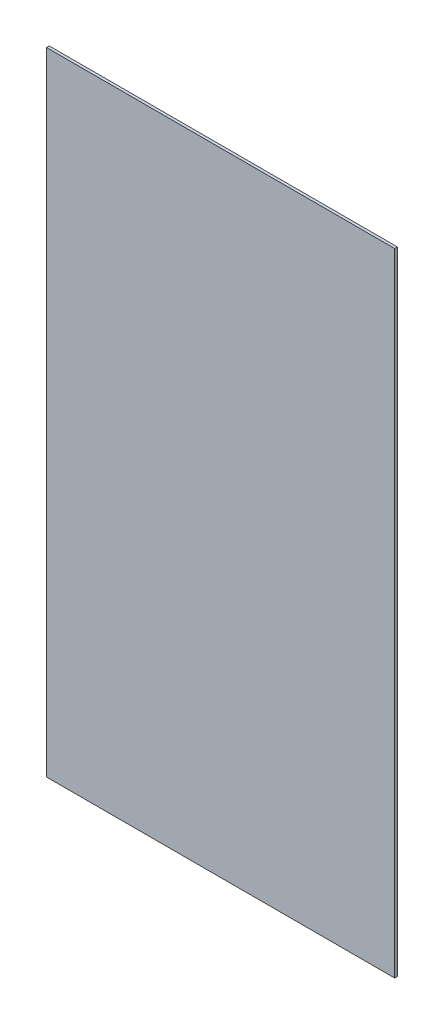
ISO-10303-21;
HEADER;
FILE_DESCRIPTION(('STEP AP214'),'2;1');
FILE_NAME('part.step','',(''),(''),'','','');
FILE_SCHEMA(('AUTOMOTIVE_DESIGN { 1 0 10303 214 1 1 1 1 }'));
ENDSEC;
DATA;
#1=APPLICATION_CONTEXT('core data for automotive mechanical design processes');
#2=APPLICATION_PROTOCOL_DEFINITION('international standard','automotive_design',2000,#1);
#3=PRODUCT_CONTEXT('',#1,'mechanical');
#4=PRODUCT('Part','Part','',(#3));
#5=PRODUCT_RELATED_PRODUCT_CATEGORY('part','',(#4));
#6=PRODUCT_DEFINITION_FORMATION('','',#4);
#7=PRODUCT_DEFINITION_CONTEXT('part definition',#1,'design');
#8=PRODUCT_DEFINITION('design','',#6,#7);
#9=PRODUCT_DEFINITION_SHAPE('','',#8);
#10=(LENGTH_UNIT() NAMED_UNIT(*) SI_UNIT(.MILLI.,.METRE.));
#11=(NAMED_UNIT(*) PLANE_ANGLE_UNIT() SI_UNIT($,.RADIAN.));
#12=(NAMED_UNIT(*) SI_UNIT($,.STERADIAN.) SOLID_ANGLE_UNIT());
#13=UNCERTAINTY_MEASURE_WITH_UNIT(LENGTH_MEASURE(1.E-05),#10,'distance_accuracy_value','');
#14=(GEOMETRIC_REPRESENTATION_CONTEXT(3) GLOBAL_UNCERTAINTY_ASSIGNED_CONTEXT((#13)) GLOBAL_UNIT_ASSIGNED_CONTEXT((#10,
#11,#12)) REPRESENTATION_CONTEXT('',''));
#15=CARTESIAN_POINT('',(0.,0.,0.));
#16=DIRECTION('',(0.,0.,1.));
#17=DIRECTION('',(1.,0.,0.));
#18=AXIS2_PLACEMENT_3D('',#15,#16,#17);
#19=CARTESIAN_POINT('',(-34.925,0.,4.7625));
#20=DIRECTION('',(1.,0.,0.));
#21=DIRECTION('',(0.,0.,-1.));
#22=AXIS2_PLACEMENT_3D('',#19,#20,#21);
#23=PLANE('',#22);
#24=DIRECTION('',(0.,-1.,0.));
#25=VECTOR('',#24,1.);
#26=CARTESIAN_POINT('',(-34.925,0.,0.));
#27=LINE('',#26,#25);
#28=CARTESIAN_POINT('',(-34.925,1095.375,0.));
#29=VERTEX_POINT('',#28);
#30=CARTESIAN_POINT('',(-34.925,0.,0.));
#31=VERTEX_POINT('',#30);
#32=EDGE_CURVE('E94',#29,#31,#27,.T.);
#33=ORIENTED_EDGE('',*,*,#32,.T.);
#34=DIRECTION('',(0.,0.,-1.));
#35=VECTOR('',#34,1.);
#36=CARTESIAN_POINT('',(-34.925,0.,4.7625));
#37=LINE('',#36,#35);
#38=CARTESIAN_POINT('',(-34.925,0.,4.7625));
#39=VERTEX_POINT('',#38);
#40=EDGE_CURVE('E11',#39,#31,#37,.T.);
#41=ORIENTED_EDGE('',*,*,#40,.F.);
#42=DIRECTION('',(0.,-1.,0.));
#43=VECTOR('',#42,1.);
#44=CARTESIAN_POINT('',(-34.925,0.,4.7625));
#45=LINE('',#44,#43);
#46=CARTESIAN_POINT('',(-34.925,1095.375,4.7625));
#47=VERTEX_POINT('',#46);
#48=EDGE_CURVE('E82',#47,#39,#45,.T.);
#49=ORIENTED_EDGE('',*,*,#48,.F.);
#50=DIRECTION('',(0.,0.,-1.));
#51=VECTOR('',#50,1.);
#52=CARTESIAN_POINT('',(-34.925,1095.375,4.7625));
#53=LINE('',#52,#51);
#54=EDGE_CURVE('E90',#47,#29,#53,.T.);
#55=ORIENTED_EDGE('',*,*,#54,.T.);
#56=EDGE_LOOP('',(#33,#41,#49,#55));
#57=FACE_BOUND('',#56,.T.);
#58=ADVANCED_FACE('F31',(#57),#23,.F.);
#59=CARTESIAN_POINT('',(-34.925,0.,4.7625));
#60=DIRECTION('',(0.,1.,0.));
#61=DIRECTION('',(0.,0.,1.));
#62=AXIS2_PLACEMENT_3D('',#59,#60,#61);
#63=PLANE('',#62);
#64=DIRECTION('',(1.,0.,0.));
#65=VECTOR('',#64,1.);
#66=CARTESIAN_POINT('',(-34.925,0.,0.));
#67=LINE('',#66,#65);
#68=CARTESIAN_POINT('',(568.325,0.,0.));
#69=VERTEX_POINT('',#68);
#70=EDGE_CURVE('E86',#31,#69,#67,.T.);
#71=ORIENTED_EDGE('',*,*,#70,.T.);
#72=DIRECTION('',(0.,0.,-1.));
#73=VECTOR('',#72,1.);
#74=CARTESIAN_POINT('',(568.325,0.,4.7625));
#75=LINE('',#74,#73);
#76=CARTESIAN_POINT('',(568.325,0.,4.7625));
#77=VERTEX_POINT('',#76);
#78=EDGE_CURVE('E39',#77,#69,#75,.T.);
#79=ORIENTED_EDGE('',*,*,#78,.F.);
#80=DIRECTION('',(1.,0.,0.));
#81=VECTOR('',#80,1.);
#82=CARTESIAN_POINT('',(-34.925,0.,4.7625));
#83=LINE('',#82,#81);
#84=EDGE_CURVE('E77',#39,#77,#83,.T.);
#85=ORIENTED_EDGE('',*,*,#84,.F.);
#86=ORIENTED_EDGE('',*,*,#40,.T.);
#87=EDGE_LOOP('',(#71,#79,#85,#86));
#88=FACE_BOUND('',#87,.T.);
#89=ADVANCED_FACE('F85',(#88),#63,.F.);
#90=CARTESIAN_POINT('',(568.325,0.,4.7625));
#91=DIRECTION('',(-1.,0.,0.));
#92=DIRECTION('',(0.,0.,1.));
#93=AXIS2_PLACEMENT_3D('',#90,#91,#92);
#94=PLANE('',#93);
#95=DIRECTION('',(0.,1.,0.));
#96=VECTOR('',#95,1.);
#97=CARTESIAN_POINT('',(568.325,0.,0.));
#98=LINE('',#97,#96);
#99=CARTESIAN_POINT('',(568.325,1095.375,0.));
#100=VERTEX_POINT('',#99);
#101=EDGE_CURVE('E64',#69,#100,#98,.T.);
#102=ORIENTED_EDGE('',*,*,#101,.T.);
#103=DIRECTION('',(0.,0.,-1.));
#104=VECTOR('',#103,1.);
#105=CARTESIAN_POINT('',(568.325,1095.375,4.7625));
#106=LINE('',#105,#104);
#107=CARTESIAN_POINT('',(568.325,1095.375,4.7625));
#108=VERTEX_POINT('',#107);
#109=EDGE_CURVE('E87',#108,#100,#106,.T.);
#110=ORIENTED_EDGE('',*,*,#109,.F.);
#111=DIRECTION('',(0.,1.,0.));
#112=VECTOR('',#111,1.);
#113=CARTESIAN_POINT('',(568.325,0.,4.7625));
#114=LINE('',#113,#112);
#115=EDGE_CURVE('E80',#77,#108,#114,.T.);
#116=ORIENTED_EDGE('',*,*,#115,.F.);
#117=ORIENTED_EDGE('',*,*,#78,.T.);
#118=EDGE_LOOP('',(#102,#110,#116,#117));
#119=FACE_BOUND('',#118,.T.);
#120=ADVANCED_FACE('F88',(#119),#94,.F.);
#121=CARTESIAN_POINT('',(-34.925,1095.375,4.7625));
#122=DIRECTION('',(0.,-1.,0.));
#123=DIRECTION('',(0.,0.,-1.));
#124=AXIS2_PLACEMENT_3D('',#121,#122,#123);
#125=PLANE('',#124);
#126=DIRECTION('',(-1.,0.,0.));
#127=VECTOR('',#126,1.);
#128=CARTESIAN_POINT('',(-34.925,1095.375,0.));
#129=LINE('',#128,#127);
#130=EDGE_CURVE('E70',#100,#29,#129,.T.);
#131=ORIENTED_EDGE('',*,*,#130,.T.);
#132=ORIENTED_EDGE('',*,*,#54,.F.);
#133=DIRECTION('',(-1.,0.,0.));
#134=VECTOR('',#133,1.);
#135=CARTESIAN_POINT('',(-34.925,1095.375,4.7625));
#136=LINE('',#135,#134);
#137=EDGE_CURVE('E47',#108,#47,#136,.T.);
#138=ORIENTED_EDGE('',*,*,#137,.F.);
#139=ORIENTED_EDGE('',*,*,#109,.T.);
#140=EDGE_LOOP('',(#131,#132,#138,#139));
#141=FACE_BOUND('',#140,.T.);
#142=ADVANCED_FACE('F101',(#141),#125,.F.);
#143=CARTESIAN_POINT('',(-34.925,1095.375,4.7625));
#144=DIRECTION('',(0.,0.,-1.));
#145=DIRECTION('',(-1.,0.,0.));
#146=AXIS2_PLACEMENT_3D('',#143,#144,#145);
#147=PLANE('',#146);
#148=ORIENTED_EDGE('',*,*,#48,.T.);
#149=ORIENTED_EDGE('',*,*,#84,.T.);
#150=ORIENTED_EDGE('',*,*,#115,.T.);
#151=ORIENTED_EDGE('',*,*,#137,.T.);
#152=EDGE_LOOP('',(#148,#149,#150,#151));
#153=FACE_BOUND('',#152,.T.);
#154=ADVANCED_FACE('F78',(#153),#147,.F.);
#155=CARTESIAN_POINT('',(-34.925,1095.375,0.));
#156=DIRECTION('',(0.,0.,-1.));
#157=DIRECTION('',(-1.,0.,0.));
#158=AXIS2_PLACEMENT_3D('',#155,#156,#157);
#159=PLANE('',#158);
#160=ORIENTED_EDGE('',*,*,#32,.F.);
#161=ORIENTED_EDGE('',*,*,#130,.F.);
#162=ORIENTED_EDGE('',*,*,#101,.F.);
#163=ORIENTED_EDGE('',*,*,#70,.F.);
#164=EDGE_LOOP('',(#160,#161,#162,#163));
#165=FACE_BOUND('',#164,.T.);
#166=ADVANCED_FACE('F104',(#165),#159,.T.);
#167=CLOSED_SHELL('',(#58,#89,#120,#142,#154,#166));
#168=MANIFOLD_SOLID_BREP('B2',#167);
#169=ADVANCED_BREP_SHAPE_REPRESENTATION('',(#18,#168),#14);
#170=SHAPE_DEFINITION_REPRESENTATION(#9,#169);
ENDSEC;
END-ISO-10303-21;
